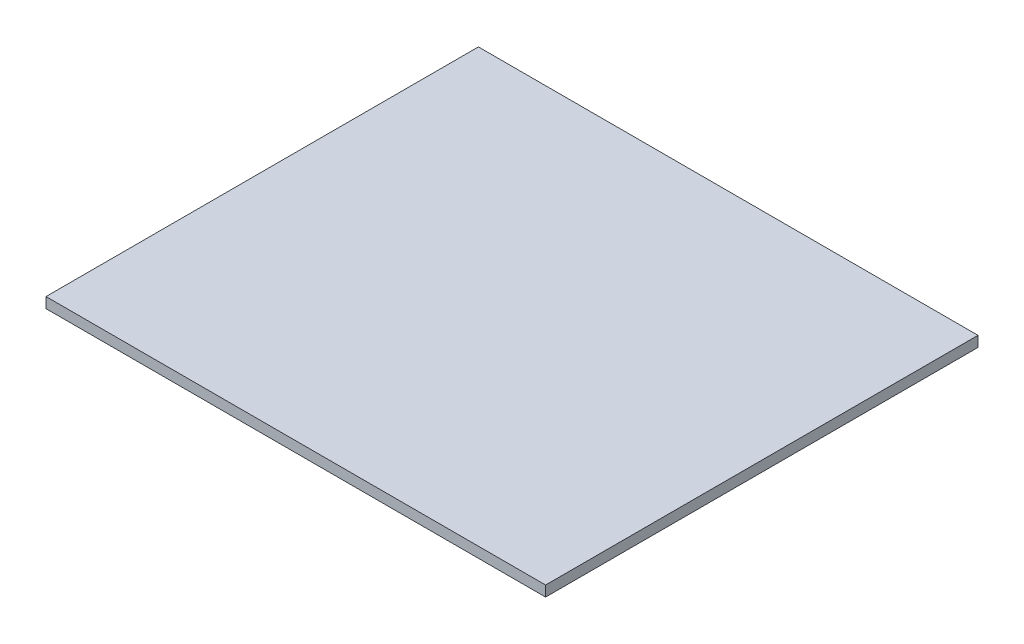
ISO-10303-21;
HEADER;
FILE_DESCRIPTION(('STEP AP214'),'2;1');
FILE_NAME('part.step','',(''),(''),'','','');
FILE_SCHEMA(('AUTOMOTIVE_DESIGN { 1 0 10303 214 1 1 1 1 }'));
ENDSEC;
DATA;
#1=APPLICATION_CONTEXT('core data for automotive mechanical design processes');
#2=APPLICATION_PROTOCOL_DEFINITION('international standard','automotive_design',2000,#1);
#3=PRODUCT_CONTEXT('',#1,'mechanical');
#4=PRODUCT('Part','Part','',(#3));
#5=PRODUCT_RELATED_PRODUCT_CATEGORY('part','',(#4));
#6=PRODUCT_DEFINITION_FORMATION('','',#4);
#7=PRODUCT_DEFINITION_CONTEXT('part definition',#1,'design');
#8=PRODUCT_DEFINITION('design','',#6,#7);
#9=PRODUCT_DEFINITION_SHAPE('','',#8);
#10=(LENGTH_UNIT() NAMED_UNIT(*) SI_UNIT(.MILLI.,.METRE.));
#11=(NAMED_UNIT(*) PLANE_ANGLE_UNIT() SI_UNIT($,.RADIAN.));
#12=(NAMED_UNIT(*) SI_UNIT($,.STERADIAN.) SOLID_ANGLE_UNIT());
#13=UNCERTAINTY_MEASURE_WITH_UNIT(LENGTH_MEASURE(1.E-05),#10,'distance_accuracy_value','');
#14=(GEOMETRIC_REPRESENTATION_CONTEXT(3) GLOBAL_UNCERTAINTY_ASSIGNED_CONTEXT((#13)) GLOBAL_UNIT_ASSIGNED_CONTEXT((#10,
#11,#12)) REPRESENTATION_CONTEXT('',''));
#15=CARTESIAN_POINT('',(0.,0.,0.));
#16=DIRECTION('',(0.,0.,1.));
#17=DIRECTION('',(1.,0.,0.));
#18=AXIS2_PLACEMENT_3D('',#15,#16,#17);
#19=CARTESIAN_POINT('',(59.5,2.5,51.5));
#20=DIRECTION('',(-1.,0.,0.));
#21=DIRECTION('',(0.,0.,1.));
#22=AXIS2_PLACEMENT_3D('',#19,#20,#21);
#23=PLANE('',#22);
#24=DIRECTION('',(0.,0.,-1.));
#25=VECTOR('',#24,1.);
#26=CARTESIAN_POINT('',(59.5,0.,51.5));
#27=LINE('',#26,#25);
#28=CARTESIAN_POINT('',(59.5,0.,51.5));
#29=VERTEX_POINT('',#28);
#30=CARTESIAN_POINT('',(59.5,0.,-51.5));
#31=VERTEX_POINT('',#30);
#32=EDGE_CURVE('E96',#29,#31,#27,.T.);
#33=ORIENTED_EDGE('',*,*,#32,.T.);
#34=DIRECTION('',(0.,-1.,0.));
#35=VECTOR('',#34,1.);
#36=CARTESIAN_POINT('',(59.5,2.5,-51.5));
#37=LINE('',#36,#35);
#38=CARTESIAN_POINT('',(59.5,2.5,-51.5));
#39=VERTEX_POINT('',#38);
#40=EDGE_CURVE('E11',#39,#31,#37,.T.);
#41=ORIENTED_EDGE('',*,*,#40,.F.);
#42=DIRECTION('',(0.,0.,-1.));
#43=VECTOR('',#42,1.);
#44=CARTESIAN_POINT('',(59.5,2.5,51.5));
#45=LINE('',#44,#43);
#46=CARTESIAN_POINT('',(59.5,2.5,51.5));
#47=VERTEX_POINT('',#46);
#48=EDGE_CURVE('E84',#47,#39,#45,.T.);
#49=ORIENTED_EDGE('',*,*,#48,.F.);
#50=DIRECTION('',(0.,-1.,0.));
#51=VECTOR('',#50,1.);
#52=CARTESIAN_POINT('',(59.5,2.5,51.5));
#53=LINE('',#52,#51);
#54=EDGE_CURVE('E92',#47,#29,#53,.T.);
#55=ORIENTED_EDGE('',*,*,#54,.T.);
#56=EDGE_LOOP('',(#33,#41,#49,#55));
#57=FACE_BOUND('',#56,.T.);
#58=ADVANCED_FACE('F33',(#57),#23,.F.);
#59=CARTESIAN_POINT('',(-59.5,2.5,-51.5));
#60=DIRECTION('',(0.,0.,1.));
#61=DIRECTION('',(1.,0.,0.));
#62=AXIS2_PLACEMENT_3D('',#59,#60,#61);
#63=PLANE('',#62);
#64=DIRECTION('',(-1.,0.,0.));
#65=VECTOR('',#64,1.);
#66=CARTESIAN_POINT('',(-59.5,0.,-51.5));
#67=LINE('',#66,#65);
#68=CARTESIAN_POINT('',(-59.5,0.,-51.5));
#69=VERTEX_POINT('',#68);
#70=EDGE_CURVE('E88',#31,#69,#67,.T.);
#71=ORIENTED_EDGE('',*,*,#70,.T.);
#72=DIRECTION('',(0.,-1.,0.));
#73=VECTOR('',#72,1.);
#74=CARTESIAN_POINT('',(-59.5,2.5,-51.5));
#75=LINE('',#74,#73);
#76=CARTESIAN_POINT('',(-59.5,2.5,-51.5));
#77=VERTEX_POINT('',#76);
#78=EDGE_CURVE('E41',#77,#69,#75,.T.);
#79=ORIENTED_EDGE('',*,*,#78,.F.);
#80=DIRECTION('',(-1.,0.,0.));
#81=VECTOR('',#80,1.);
#82=CARTESIAN_POINT('',(-59.5,2.5,-51.5));
#83=LINE('',#82,#81);
#84=EDGE_CURVE('E79',#39,#77,#83,.T.);
#85=ORIENTED_EDGE('',*,*,#84,.F.);
#86=ORIENTED_EDGE('',*,*,#40,.T.);
#87=EDGE_LOOP('',(#71,#79,#85,#86));
#88=FACE_BOUND('',#87,.T.);
#89=ADVANCED_FACE('F87',(#88),#63,.F.);
#90=CARTESIAN_POINT('',(-59.5,2.5,51.5));
#91=DIRECTION('',(1.,0.,0.));
#92=DIRECTION('',(0.,0.,-1.));
#93=AXIS2_PLACEMENT_3D('',#90,#91,#92);
#94=PLANE('',#93);
#95=DIRECTION('',(0.,0.,1.));
#96=VECTOR('',#95,1.);
#97=CARTESIAN_POINT('',(-59.5,0.,51.5));
#98=LINE('',#97,#96);
#99=CARTESIAN_POINT('',(-59.5,0.,51.5));
#100=VERTEX_POINT('',#99);
#101=EDGE_CURVE('E66',#69,#100,#98,.T.);
#102=ORIENTED_EDGE('',*,*,#101,.T.);
#103=DIRECTION('',(0.,-1.,0.));
#104=VECTOR('',#103,1.);
#105=CARTESIAN_POINT('',(-59.5,2.5,51.5));
#106=LINE('',#105,#104);
#107=CARTESIAN_POINT('',(-59.5,2.5,51.5));
#108=VERTEX_POINT('',#107);
#109=EDGE_CURVE('E89',#108,#100,#106,.T.);
#110=ORIENTED_EDGE('',*,*,#109,.F.);
#111=DIRECTION('',(0.,0.,1.));
#112=VECTOR('',#111,1.);
#113=CARTESIAN_POINT('',(-59.5,2.5,51.5));
#114=LINE('',#113,#112);
#115=EDGE_CURVE('E82',#77,#108,#114,.T.);
#116=ORIENTED_EDGE('',*,*,#115,.F.);
#117=ORIENTED_EDGE('',*,*,#78,.T.);
#118=EDGE_LOOP('',(#102,#110,#116,#117));
#119=FACE_BOUND('',#118,.T.);
#120=ADVANCED_FACE('F90',(#119),#94,.F.);
#121=CARTESIAN_POINT('',(-59.5,2.5,51.5));
#122=DIRECTION('',(0.,0.,-1.));
#123=DIRECTION('',(-1.,0.,0.));
#124=AXIS2_PLACEMENT_3D('',#121,#122,#123);
#125=PLANE('',#124);
#126=DIRECTION('',(1.,0.,0.));
#127=VECTOR('',#126,1.);
#128=CARTESIAN_POINT('',(-59.5,0.,51.5));
#129=LINE('',#128,#127);
#130=EDGE_CURVE('E72',#100,#29,#129,.T.);
#131=ORIENTED_EDGE('',*,*,#130,.T.);
#132=ORIENTED_EDGE('',*,*,#54,.F.);
#133=DIRECTION('',(1.,0.,0.));
#134=VECTOR('',#133,1.);
#135=CARTESIAN_POINT('',(-59.5,2.5,51.5));
#136=LINE('',#135,#134);
#137=EDGE_CURVE('E49',#108,#47,#136,.T.);
#138=ORIENTED_EDGE('',*,*,#137,.F.);
#139=ORIENTED_EDGE('',*,*,#109,.T.);
#140=EDGE_LOOP('',(#131,#132,#138,#139));
#141=FACE_BOUND('',#140,.T.);
#142=ADVANCED_FACE('F103',(#141),#125,.F.);
#143=CARTESIAN_POINT('',(0.,2.5,0.));
#144=DIRECTION('',(0.,-1.,0.));
#145=DIRECTION('',(0.,0.,-1.));
#146=AXIS2_PLACEMENT_3D('',#143,#144,#145);
#147=PLANE('',#146);
#148=ORIENTED_EDGE('',*,*,#48,.T.);
#149=ORIENTED_EDGE('',*,*,#84,.T.);
#150=ORIENTED_EDGE('',*,*,#115,.T.);
#151=ORIENTED_EDGE('',*,*,#137,.T.);
#152=EDGE_LOOP('',(#148,#149,#150,#151));
#153=FACE_BOUND('',#152,.T.);
#154=ADVANCED_FACE('F80',(#153),#147,.F.);
#155=CARTESIAN_POINT('',(0.,0.,0.));
#156=DIRECTION('',(0.,-1.,0.));
#157=DIRECTION('',(0.,0.,-1.));
#158=AXIS2_PLACEMENT_3D('',#155,#156,#157);
#159=PLANE('',#158);
#160=ORIENTED_EDGE('',*,*,#32,.F.);
#161=ORIENTED_EDGE('',*,*,#130,.F.);
#162=ORIENTED_EDGE('',*,*,#101,.F.);
#163=ORIENTED_EDGE('',*,*,#70,.F.);
#164=EDGE_LOOP('',(#160,#161,#162,#163));
#165=FACE_BOUND('',#164,.T.);
#166=ADVANCED_FACE('F106',(#165),#159,.T.);
#167=CLOSED_SHELL('',(#58,#89,#120,#142,#154,#166));
#168=MANIFOLD_SOLID_BREP('B2',#167);
#169=ADVANCED_BREP_SHAPE_REPRESENTATION('',(#18,#168),#14);
#170=SHAPE_DEFINITION_REPRESENTATION(#9,#169);
ENDSEC;
END-ISO-10303-21;
